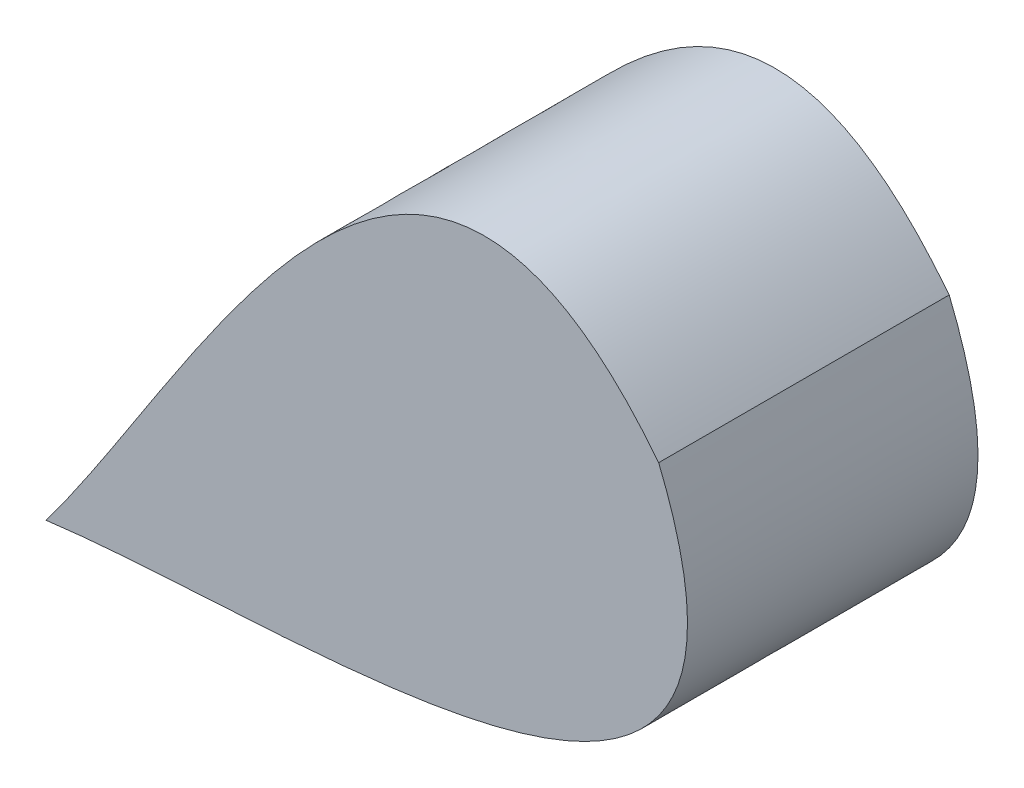
ISO-10303-21;
HEADER;
FILE_DESCRIPTION(('STEP AP214'),'2;1');
FILE_NAME('part.step','',(''),(''),'','','');
FILE_SCHEMA(('AUTOMOTIVE_DESIGN { 1 0 10303 214 1 1 1 1 }'));
ENDSEC;
DATA;
#1=APPLICATION_CONTEXT('core data for automotive mechanical design processes');
#2=APPLICATION_PROTOCOL_DEFINITION('international standard','automotive_design',2000,#1);
#3=PRODUCT_CONTEXT('',#1,'mechanical');
#4=PRODUCT('Part','Part','',(#3));
#5=PRODUCT_RELATED_PRODUCT_CATEGORY('part','',(#4));
#6=PRODUCT_DEFINITION_FORMATION('','',#4);
#7=PRODUCT_DEFINITION_CONTEXT('part definition',#1,'design');
#8=PRODUCT_DEFINITION('design','',#6,#7);
#9=PRODUCT_DEFINITION_SHAPE('','',#8);
#10=(LENGTH_UNIT() NAMED_UNIT(*) SI_UNIT(.MILLI.,.METRE.));
#11=(NAMED_UNIT(*) PLANE_ANGLE_UNIT() SI_UNIT($,.RADIAN.));
#12=(NAMED_UNIT(*) SI_UNIT($,.STERADIAN.) SOLID_ANGLE_UNIT());
#13=UNCERTAINTY_MEASURE_WITH_UNIT(LENGTH_MEASURE(1.E-05),#10,'distance_accuracy_value','');
#14=(GEOMETRIC_REPRESENTATION_CONTEXT(3) GLOBAL_UNCERTAINTY_ASSIGNED_CONTEXT((#13)) GLOBAL_UNIT_ASSIGNED_CONTEXT((#10,
#11,#12)) REPRESENTATION_CONTEXT('',''));
#15=CARTESIAN_POINT('',(0.,0.,0.));
#16=DIRECTION('',(0.,0.,1.));
#17=DIRECTION('',(1.,0.,0.));
#18=AXIS2_PLACEMENT_3D('',#15,#16,#17);
#19=CARTESIAN_POINT('',(948.090064485484,759.21318970826,10.));
#20=CARTESIAN_POINT('',(957.029634779051,760.385133095863,10.));
#21=CARTESIAN_POINT('',(974.513214795002,758.495372877404,10.));
#22=CARTESIAN_POINT('',(969.179875653115,771.473957673155,10.));
#23=B_SPLINE_CURVE_WITH_KNOTS('',3,(#19,#20,#21,#22),.UNSPECIFIED.,.F.,.F.,(4,4),(0.,1.),.UNSPECIFIED.);
#24=DIRECTION('',(0.,0.,-1.));
#25=VECTOR('',#24,1.);
#26=SURFACE_OF_LINEAR_EXTRUSION('',#23,#25);
#27=CARTESIAN_POINT('',(948.090064485484,759.21318970826,0.));
#28=CARTESIAN_POINT('',(957.029634779051,760.385133095863,0.));
#29=CARTESIAN_POINT('',(974.513214795002,758.495372877404,0.));
#30=CARTESIAN_POINT('',(969.179875653115,771.473957673155,0.));
#31=B_SPLINE_CURVE_WITH_KNOTS('',3,(#27,#28,#29,#30),.UNSPECIFIED.,.F.,.F.,(4,4),(0.,1.),.UNSPECIFIED.);
#32=CARTESIAN_POINT('',(948.090064485484,759.21318970826,0.));
#33=VERTEX_POINT('',#32);
#34=CARTESIAN_POINT('',(969.179875653115,771.473957673155,0.));
#35=VERTEX_POINT('',#34);
#36=EDGE_CURVE('E65',#33,#35,#31,.T.);
#37=ORIENTED_EDGE('',*,*,#36,.T.);
#38=DIRECTION('',(0.,0.,-1.));
#39=VECTOR('',#38,1.);
#40=CARTESIAN_POINT('',(969.179875653115,771.473957673155,10.));
#41=LINE('',#40,#39);
#42=CARTESIAN_POINT('',(969.179875653115,771.473957673155,10.));
#43=VERTEX_POINT('',#42);
#44=EDGE_CURVE('E11',#43,#35,#41,.T.);
#45=ORIENTED_EDGE('',*,*,#44,.F.);
#46=CARTESIAN_POINT('',(948.090064485484,759.21318970826,10.));
#47=VERTEX_POINT('',#46);
#48=EDGE_CURVE('E64',#47,#43,#23,.T.);
#49=ORIENTED_EDGE('',*,*,#48,.F.);
#50=DIRECTION('',(0.,0.,-1.));
#51=VECTOR('',#50,1.);
#52=CARTESIAN_POINT('',(948.090064485484,759.21318970826,10.));
#53=LINE('',#52,#51);
#54=EDGE_CURVE('E42',#47,#33,#53,.T.);
#55=ORIENTED_EDGE('',*,*,#54,.T.);
#56=EDGE_LOOP('',(#37,#45,#49,#55));
#57=FACE_BOUND('',#56,.T.);
#58=ADVANCED_FACE('F33',(#57),#26,.F.);
#59=CARTESIAN_POINT('',(969.179875653115,771.473957673155,10.));
#60=CARTESIAN_POINT('',(960.540224930799,782.530385898368,10.));
#61=CARTESIAN_POINT('',(953.531720885872,766.401913096838,10.));
#62=CARTESIAN_POINT('',(948.090064485484,759.21318970826,10.));
#63=B_SPLINE_CURVE_WITH_KNOTS('',3,(#59,#60,#61,#62),.UNSPECIFIED.,.F.,.F.,(4,4),(0.,1.),.UNSPECIFIED.);
#64=DIRECTION('',(0.,0.,-1.));
#65=VECTOR('',#64,1.);
#66=SURFACE_OF_LINEAR_EXTRUSION('',#63,#65);
#67=CARTESIAN_POINT('',(969.179875653115,771.473957673155,0.));
#68=CARTESIAN_POINT('',(960.540224930799,782.530385898368,0.));
#69=CARTESIAN_POINT('',(953.531720885872,766.401913096838,0.));
#70=CARTESIAN_POINT('',(948.090064485484,759.21318970826,0.));
#71=B_SPLINE_CURVE_WITH_KNOTS('',3,(#67,#68,#69,#70),.UNSPECIFIED.,.F.,.F.,(4,4),(0.,1.),.UNSPECIFIED.);
#72=EDGE_CURVE('E57',#35,#33,#71,.T.);
#73=ORIENTED_EDGE('',*,*,#72,.T.);
#74=ORIENTED_EDGE('',*,*,#54,.F.);
#75=EDGE_CURVE('E49',#43,#47,#63,.T.);
#76=ORIENTED_EDGE('',*,*,#75,.F.);
#77=ORIENTED_EDGE('',*,*,#44,.T.);
#78=EDGE_LOOP('',(#73,#74,#76,#77));
#79=FACE_BOUND('',#78,.T.);
#80=ADVANCED_FACE('F60',(#79),#66,.F.);
#81=CARTESIAN_POINT('',(963.987311107595,760.916083162652,10.));
#82=DIRECTION('',(0.,0.,1.));
#83=DIRECTION('',(1.,0.,0.));
#84=AXIS2_PLACEMENT_3D('',#81,#82,#83);
#85=PLANE('',#84);
#86=ORIENTED_EDGE('',*,*,#48,.T.);
#87=ORIENTED_EDGE('',*,*,#75,.T.);
#88=EDGE_LOOP('',(#86,#87));
#89=FACE_BOUND('',#88,.T.);
#90=ADVANCED_FACE('F92',(#89),#85,.T.);
#91=CARTESIAN_POINT('',(963.987311107595,760.916083162652,0.));
#92=DIRECTION('',(0.,0.,1.));
#93=DIRECTION('',(1.,0.,0.));
#94=AXIS2_PLACEMENT_3D('',#91,#92,#93);
#95=PLANE('',#94);
#96=ORIENTED_EDGE('',*,*,#36,.F.);
#97=ORIENTED_EDGE('',*,*,#72,.F.);
#98=EDGE_LOOP('',(#96,#97));
#99=FACE_BOUND('',#98,.T.);
#100=ADVANCED_FACE('F68',(#99),#95,.F.);
#101=CLOSED_SHELL('',(#58,#80,#90,#100));
#102=MANIFOLD_SOLID_BREP('B2',#101);
#103=ADVANCED_BREP_SHAPE_REPRESENTATION('',(#18,#102),#14);
#104=SHAPE_DEFINITION_REPRESENTATION(#9,#103);
ENDSEC;
END-ISO-10303-21;
